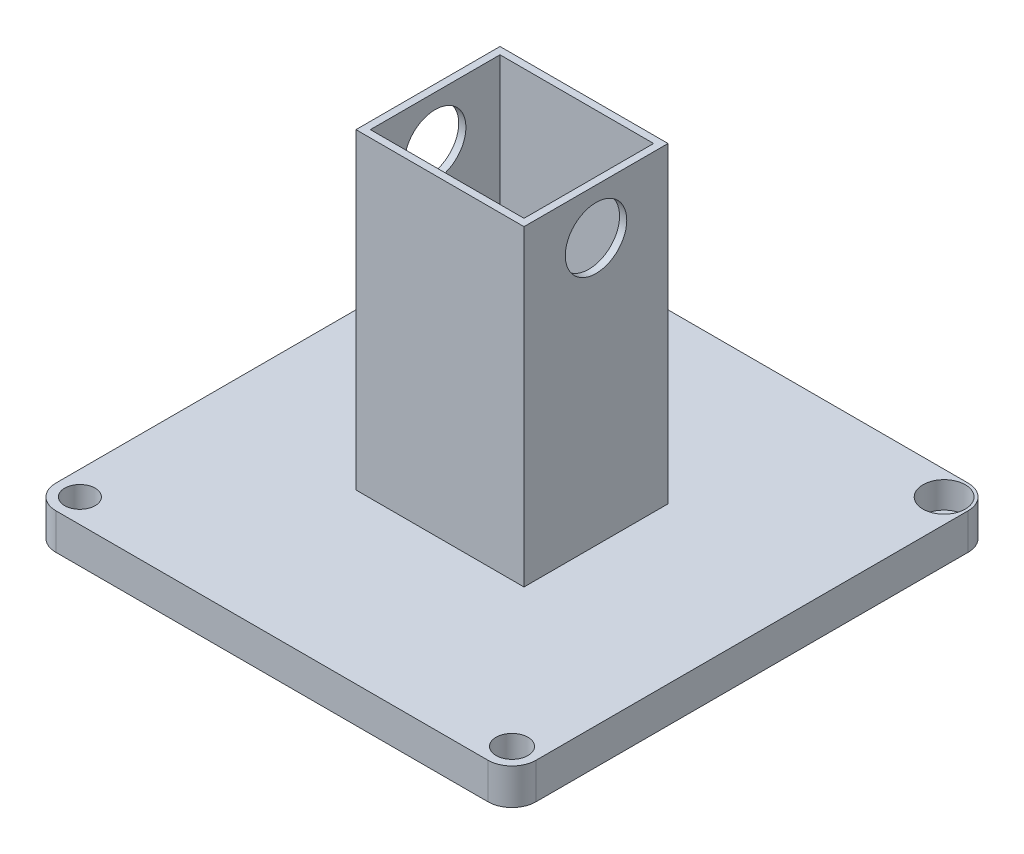
ISO-10303-21;
HEADER;
FILE_DESCRIPTION(('STEP AP214'),'2;1');
FILE_NAME('part.step','',(''),(''),'','','');
FILE_SCHEMA(('AUTOMOTIVE_DESIGN { 1 0 10303 214 1 1 1 1 }'));
ENDSEC;
DATA;
#1=APPLICATION_CONTEXT('core data for automotive mechanical design processes');
#2=APPLICATION_PROTOCOL_DEFINITION('international standard','automotive_design',2000,#1);
#3=PRODUCT_CONTEXT('',#1,'mechanical');
#4=PRODUCT('Part','Part','',(#3));
#5=PRODUCT_RELATED_PRODUCT_CATEGORY('part','',(#4));
#6=PRODUCT_DEFINITION_FORMATION('','',#4);
#7=PRODUCT_DEFINITION_CONTEXT('part definition',#1,'design');
#8=PRODUCT_DEFINITION('design','',#6,#7);
#9=PRODUCT_DEFINITION_SHAPE('','',#8);
#10=(LENGTH_UNIT() NAMED_UNIT(*) SI_UNIT(.MILLI.,.METRE.));
#11=(NAMED_UNIT(*) PLANE_ANGLE_UNIT() SI_UNIT($,.RADIAN.));
#12=(NAMED_UNIT(*) SI_UNIT($,.STERADIAN.) SOLID_ANGLE_UNIT());
#13=UNCERTAINTY_MEASURE_WITH_UNIT(LENGTH_MEASURE(1.E-05),#10,'distance_accuracy_value','');
#14=(GEOMETRIC_REPRESENTATION_CONTEXT(3) GLOBAL_UNCERTAINTY_ASSIGNED_CONTEXT((#13)) GLOBAL_UNIT_ASSIGNED_CONTEXT((#10,
#11,#12)) REPRESENTATION_CONTEXT('',''));
#15=CARTESIAN_POINT('',(0.,0.,0.));
#16=DIRECTION('',(0.,0.,1.));
#17=DIRECTION('',(1.,0.,0.));
#18=AXIS2_PLACEMENT_3D('',#15,#16,#17);
#19=CARTESIAN_POINT('',(90.,15.,-90.));
#20=DIRECTION('',(0.,-1.,0.));
#21=DIRECTION('',(0.,0.,-1.));
#22=AXIS2_PLACEMENT_3D('',#19,#20,#21);
#23=PLANE('',#22);
#24=CARTESIAN_POINT('',(90.,15.,-90.));
#25=DIRECTION('',(0.,1.,0.));
#26=DIRECTION('',(0.,0.,1.));
#27=AXIS2_PLACEMENT_3D('',#24,#25,#26);
#28=CIRCLE('',#27,8.81355523044858);
#29=CARTESIAN_POINT('',(90.,15.,-81.1864447695514));
#30=VERTEX_POINT('',#29);
#31=EDGE_CURVE('E442',#30,#30,#28,.T.);
#32=ORIENTED_EDGE('',*,*,#31,.F.);
#33=EDGE_LOOP('',(#32));
#34=FACE_BOUND('',#33,.T.);
#35=CARTESIAN_POINT('',(-90.,15.,90.));
#36=DIRECTION('',(0.,1.,0.));
#37=DIRECTION('',(0.,0.,1.));
#38=AXIS2_PLACEMENT_3D('',#35,#36,#37);
#39=CIRCLE('',#38,6.34028502442112);
#40=CARTESIAN_POINT('',(-90.,15.,96.3402850244211));
#41=VERTEX_POINT('',#40);
#42=EDGE_CURVE('E451',#41,#41,#39,.T.);
#43=ORIENTED_EDGE('',*,*,#42,.F.);
#44=EDGE_LOOP('',(#43));
#45=FACE_BOUND('',#44,.T.);
#46=CARTESIAN_POINT('',(90.,15.,90.));
#47=DIRECTION('',(0.,1.,0.));
#48=DIRECTION('',(0.,0.,1.));
#49=AXIS2_PLACEMENT_3D('',#46,#47,#48);
#50=CIRCLE('',#49,6.6333628858936);
#51=CARTESIAN_POINT('',(90.,15.,96.6333628858936));
#52=VERTEX_POINT('',#51);
#53=EDGE_CURVE('E457',#52,#52,#50,.T.);
#54=ORIENTED_EDGE('',*,*,#53,.F.);
#55=EDGE_LOOP('',(#54));
#56=FACE_BOUND('',#55,.T.);
#57=CARTESIAN_POINT('',(-90.,15.,-90.));
#58=DIRECTION('',(0.,1.,0.));
#59=DIRECTION('',(0.,0.,1.));
#60=AXIS2_PLACEMENT_3D('',#57,#58,#59);
#61=CIRCLE('',#60,8.19003124874953);
#62=CARTESIAN_POINT('',(-90.,15.,-81.8099687512505));
#63=VERTEX_POINT('',#62);
#64=EDGE_CURVE('E393',#63,#63,#61,.T.);
#65=ORIENTED_EDGE('',*,*,#64,.F.);
#66=EDGE_LOOP('',(#65));
#67=FACE_BOUND('',#66,.T.);
#68=CARTESIAN_POINT('',(90.,15.,-90.));
#69=DIRECTION('',(0.,1.,0.));
#70=DIRECTION('',(0.,0.,-1.));
#71=AXIS2_PLACEMENT_3D('',#68,#69,#70);
#72=CIRCLE('',#71,9.99999999999999);
#73=CARTESIAN_POINT('',(100.,15.,-90.));
#74=VERTEX_POINT('',#73);
#75=CARTESIAN_POINT('',(90.,15.,-100.));
#76=VERTEX_POINT('',#75);
#77=EDGE_CURVE('E217',#74,#76,#72,.T.);
#78=ORIENTED_EDGE('',*,*,#77,.T.);
#79=DIRECTION('',(-1.,0.,0.));
#80=VECTOR('',#79,1.);
#81=CARTESIAN_POINT('',(-90.,15.,-100.));
#82=LINE('',#81,#80);
#83=CARTESIAN_POINT('',(-90.,15.,-100.));
#84=VERTEX_POINT('',#83);
#85=EDGE_CURVE('E220',#76,#84,#82,.T.);
#86=ORIENTED_EDGE('',*,*,#85,.T.);
#87=CARTESIAN_POINT('',(-90.,15.,-90.));
#88=DIRECTION('',(0.,1.,0.));
#89=DIRECTION('',(0.,0.,1.));
#90=AXIS2_PLACEMENT_3D('',#87,#88,#89);
#91=CIRCLE('',#90,10.);
#92=CARTESIAN_POINT('',(-100.,15.,-90.));
#93=VERTEX_POINT('',#92);
#94=EDGE_CURVE('E223',#84,#93,#91,.T.);
#95=ORIENTED_EDGE('',*,*,#94,.T.);
#96=DIRECTION('',(0.,0.,1.));
#97=VECTOR('',#96,1.);
#98=CARTESIAN_POINT('',(-100.,15.,-90.));
#99=LINE('',#98,#97);
#100=CARTESIAN_POINT('',(-100.,15.,90.));
#101=VERTEX_POINT('',#100);
#102=EDGE_CURVE('E225',#93,#101,#99,.T.);
#103=ORIENTED_EDGE('',*,*,#102,.T.);
#104=CARTESIAN_POINT('',(-90.,15.,90.));
#105=DIRECTION('',(0.,1.,0.));
#106=DIRECTION('',(0.,0.,1.));
#107=AXIS2_PLACEMENT_3D('',#104,#105,#106);
#108=CIRCLE('',#107,9.99999999999999);
#109=CARTESIAN_POINT('',(-90.,15.,100.));
#110=VERTEX_POINT('',#109);
#111=EDGE_CURVE('E227',#101,#110,#108,.T.);
#112=ORIENTED_EDGE('',*,*,#111,.T.);
#113=DIRECTION('',(1.,0.,0.));
#114=VECTOR('',#113,1.);
#115=CARTESIAN_POINT('',(-90.,15.,100.));
#116=LINE('',#115,#114);
#117=CARTESIAN_POINT('',(90.,15.,100.));
#118=VERTEX_POINT('',#117);
#119=EDGE_CURVE('E229',#110,#118,#116,.T.);
#120=ORIENTED_EDGE('',*,*,#119,.T.);
#121=CARTESIAN_POINT('',(90.,15.,90.));
#122=DIRECTION('',(0.,1.,0.));
#123=DIRECTION('',(0.,0.,1.));
#124=AXIS2_PLACEMENT_3D('',#121,#122,#123);
#125=CIRCLE('',#124,9.99999999999998);
#126=CARTESIAN_POINT('',(100.,15.,90.));
#127=VERTEX_POINT('',#126);
#128=EDGE_CURVE('E231',#118,#127,#125,.T.);
#129=ORIENTED_EDGE('',*,*,#128,.T.);
#130=DIRECTION('',(0.,0.,-1.));
#131=VECTOR('',#130,1.);
#132=CARTESIAN_POINT('',(100.,15.,-90.));
#133=LINE('',#132,#131);
#134=EDGE_CURVE('E233',#127,#74,#133,.T.);
#135=ORIENTED_EDGE('',*,*,#134,.T.);
#136=EDGE_LOOP('',(#78,#86,#95,#103,#112,#120,#129,#135));
#137=FACE_BOUND('',#136,.T.);
#138=DIRECTION('',(0.,0.,-1.));
#139=VECTOR('',#138,1.);
#140=CARTESIAN_POINT('',(35.,15.,-30.));
#141=LINE('',#140,#139);
#142=CARTESIAN_POINT('',(35.,15.,30.));
#143=VERTEX_POINT('',#142);
#144=CARTESIAN_POINT('',(35.,15.,-30.));
#145=VERTEX_POINT('',#144);
#146=EDGE_CURVE('E163',#143,#145,#141,.T.);
#147=ORIENTED_EDGE('',*,*,#146,.F.);
#148=DIRECTION('',(1.,0.,0.));
#149=VECTOR('',#148,1.);
#150=CARTESIAN_POINT('',(-35.,15.,30.));
#151=LINE('',#150,#149);
#152=CARTESIAN_POINT('',(-35.,15.,30.));
#153=VERTEX_POINT('',#152);
#154=EDGE_CURVE('E193',#153,#143,#151,.T.);
#155=ORIENTED_EDGE('',*,*,#154,.F.);
#156=DIRECTION('',(0.,0.,1.));
#157=VECTOR('',#156,1.);
#158=CARTESIAN_POINT('',(-35.,15.,-30.));
#159=LINE('',#158,#157);
#160=CARTESIAN_POINT('',(-35.,15.,-30.));
#161=VERTEX_POINT('',#160);
#162=EDGE_CURVE('E53',#161,#153,#159,.T.);
#163=ORIENTED_EDGE('',*,*,#162,.F.);
#164=DIRECTION('',(-1.,0.,0.));
#165=VECTOR('',#164,1.);
#166=CARTESIAN_POINT('',(-35.,15.,-30.));
#167=LINE('',#166,#165);
#168=EDGE_CURVE('E48',#145,#161,#167,.T.);
#169=ORIENTED_EDGE('',*,*,#168,.F.);
#170=EDGE_LOOP('',(#147,#155,#163,#169));
#171=FACE_BOUND('',#170,.T.);
#172=ADVANCED_FACE('F32',(#34,#45,#56,#67,#137,#171),#23,.F.);
#173=CARTESIAN_POINT('',(90.,15.,-90.));
#174=DIRECTION('',(0.,-1.,0.));
#175=DIRECTION('',(0.,0.,-1.));
#176=AXIS2_PLACEMENT_3D('',#173,#174,#175);
#177=CYLINDRICAL_SURFACE('',#176,9.99999999999999);
#178=CARTESIAN_POINT('',(90.,0.,-90.));
#179=DIRECTION('',(0.,1.,0.));
#180=DIRECTION('',(0.,0.,-1.));
#181=AXIS2_PLACEMENT_3D('',#178,#179,#180);
#182=CIRCLE('',#181,9.99999999999999);
#183=CARTESIAN_POINT('',(100.,0.,-90.));
#184=VERTEX_POINT('',#183);
#185=CARTESIAN_POINT('',(90.,0.,-100.));
#186=VERTEX_POINT('',#185);
#187=EDGE_CURVE('E216',#184,#186,#182,.T.);
#188=ORIENTED_EDGE('',*,*,#187,.T.);
#189=DIRECTION('',(0.,-1.,0.));
#190=VECTOR('',#189,1.);
#191=CARTESIAN_POINT('',(90.,15.,-100.));
#192=LINE('',#191,#190);
#193=EDGE_CURVE('E11',#76,#186,#192,.T.);
#194=ORIENTED_EDGE('',*,*,#193,.F.);
#195=ORIENTED_EDGE('',*,*,#77,.F.);
#196=DIRECTION('',(0.,-1.,0.));
#197=VECTOR('',#196,1.);
#198=CARTESIAN_POINT('',(100.,15.,-90.));
#199=LINE('',#198,#197);
#200=EDGE_CURVE('E235',#74,#184,#199,.T.);
#201=ORIENTED_EDGE('',*,*,#200,.T.);
#202=EDGE_LOOP('',(#188,#194,#195,#201));
#203=FACE_BOUND('',#202,.T.);
#204=ADVANCED_FACE('F34',(#203),#177,.T.);
#205=CARTESIAN_POINT('',(-90.,15.,-100.));
#206=DIRECTION('',(0.,0.,1.));
#207=DIRECTION('',(1.,0.,0.));
#208=AXIS2_PLACEMENT_3D('',#205,#206,#207);
#209=PLANE('',#208);
#210=DIRECTION('',(-1.,0.,0.));
#211=VECTOR('',#210,1.);
#212=CARTESIAN_POINT('',(-90.,0.,-100.));
#213=LINE('',#212,#211);
#214=CARTESIAN_POINT('',(-90.,0.,-100.));
#215=VERTEX_POINT('',#214);
#216=EDGE_CURVE('E238',#186,#215,#213,.T.);
#217=ORIENTED_EDGE('',*,*,#216,.T.);
#218=DIRECTION('',(0.,-1.,0.));
#219=VECTOR('',#218,1.);
#220=CARTESIAN_POINT('',(-90.,15.,-100.));
#221=LINE('',#220,#219);
#222=EDGE_CURVE('E41',#84,#215,#221,.T.);
#223=ORIENTED_EDGE('',*,*,#222,.F.);
#224=ORIENTED_EDGE('',*,*,#85,.F.);
#225=ORIENTED_EDGE('',*,*,#193,.T.);
#226=EDGE_LOOP('',(#217,#223,#224,#225));
#227=FACE_BOUND('',#226,.T.);
#228=ADVANCED_FACE('F295',(#227),#209,.F.);
#229=CARTESIAN_POINT('',(-90.,15.,-90.));
#230=DIRECTION('',(0.,-1.,0.));
#231=DIRECTION('',(0.,0.,-1.));
#232=AXIS2_PLACEMENT_3D('',#229,#230,#231);
#233=CYLINDRICAL_SURFACE('',#232,10.);
#234=CARTESIAN_POINT('',(-90.,0.,-90.));
#235=DIRECTION('',(0.,1.,0.));
#236=DIRECTION('',(0.,0.,1.));
#237=AXIS2_PLACEMENT_3D('',#234,#235,#236);
#238=CIRCLE('',#237,10.);
#239=CARTESIAN_POINT('',(-100.,0.,-90.));
#240=VERTEX_POINT('',#239);
#241=EDGE_CURVE('E240',#215,#240,#238,.T.);
#242=ORIENTED_EDGE('',*,*,#241,.T.);
#243=DIRECTION('',(0.,-1.,0.));
#244=VECTOR('',#243,1.);
#245=CARTESIAN_POINT('',(-100.,15.,-90.));
#246=LINE('',#245,#244);
#247=EDGE_CURVE('E265',#93,#240,#246,.T.);
#248=ORIENTED_EDGE('',*,*,#247,.F.);
#249=ORIENTED_EDGE('',*,*,#94,.F.);
#250=ORIENTED_EDGE('',*,*,#222,.T.);
#251=EDGE_LOOP('',(#242,#248,#249,#250));
#252=FACE_BOUND('',#251,.T.);
#253=ADVANCED_FACE('F273',(#252),#233,.T.);
#254=CARTESIAN_POINT('',(-100.,15.,-90.));
#255=DIRECTION('',(1.,0.,0.));
#256=DIRECTION('',(0.,0.,-1.));
#257=AXIS2_PLACEMENT_3D('',#254,#255,#256);
#258=PLANE('',#257);
#259=DIRECTION('',(0.,0.,1.));
#260=VECTOR('',#259,1.);
#261=CARTESIAN_POINT('',(-100.,0.,-90.));
#262=LINE('',#261,#260);
#263=CARTESIAN_POINT('',(-100.,0.,90.));
#264=VERTEX_POINT('',#263);
#265=EDGE_CURVE('E242',#240,#264,#262,.T.);
#266=ORIENTED_EDGE('',*,*,#265,.T.);
#267=DIRECTION('',(0.,-1.,0.));
#268=VECTOR('',#267,1.);
#269=CARTESIAN_POINT('',(-100.,15.,90.));
#270=LINE('',#269,#268);
#271=EDGE_CURVE('E262',#101,#264,#270,.T.);
#272=ORIENTED_EDGE('',*,*,#271,.F.);
#273=ORIENTED_EDGE('',*,*,#102,.F.);
#274=ORIENTED_EDGE('',*,*,#247,.T.);
#275=EDGE_LOOP('',(#266,#272,#273,#274));
#276=FACE_BOUND('',#275,.T.);
#277=ADVANCED_FACE('F284',(#276),#258,.F.);
#278=CARTESIAN_POINT('',(-90.,15.,90.));
#279=DIRECTION('',(0.,-1.,0.));
#280=DIRECTION('',(0.,0.,-1.));
#281=AXIS2_PLACEMENT_3D('',#278,#279,#280);
#282=CYLINDRICAL_SURFACE('',#281,9.99999999999999);
#283=CARTESIAN_POINT('',(-90.,0.,90.));
#284=DIRECTION('',(0.,1.,0.));
#285=DIRECTION('',(0.,0.,1.));
#286=AXIS2_PLACEMENT_3D('',#283,#284,#285);
#287=CIRCLE('',#286,9.99999999999999);
#288=CARTESIAN_POINT('',(-90.,0.,100.));
#289=VERTEX_POINT('',#288);
#290=EDGE_CURVE('E244',#264,#289,#287,.T.);
#291=ORIENTED_EDGE('',*,*,#290,.T.);
#292=DIRECTION('',(0.,-1.,0.));
#293=VECTOR('',#292,1.);
#294=CARTESIAN_POINT('',(-90.,15.,100.));
#295=LINE('',#294,#293);
#296=EDGE_CURVE('E259',#110,#289,#295,.T.);
#297=ORIENTED_EDGE('',*,*,#296,.F.);
#298=ORIENTED_EDGE('',*,*,#111,.F.);
#299=ORIENTED_EDGE('',*,*,#271,.T.);
#300=EDGE_LOOP('',(#291,#297,#298,#299));
#301=FACE_BOUND('',#300,.T.);
#302=ADVANCED_FACE('F288',(#301),#282,.T.);
#303=CARTESIAN_POINT('',(-90.,15.,100.));
#304=DIRECTION('',(0.,0.,-1.));
#305=DIRECTION('',(-1.,0.,0.));
#306=AXIS2_PLACEMENT_3D('',#303,#304,#305);
#307=PLANE('',#306);
#308=DIRECTION('',(1.,0.,0.));
#309=VECTOR('',#308,1.);
#310=CARTESIAN_POINT('',(-90.,0.,100.));
#311=LINE('',#310,#309);
#312=CARTESIAN_POINT('',(90.,0.,100.));
#313=VERTEX_POINT('',#312);
#314=EDGE_CURVE('E246',#289,#313,#311,.T.);
#315=ORIENTED_EDGE('',*,*,#314,.T.);
#316=DIRECTION('',(0.,-1.,0.));
#317=VECTOR('',#316,1.);
#318=CARTESIAN_POINT('',(90.,15.,100.));
#319=LINE('',#318,#317);
#320=EDGE_CURVE('E256',#118,#313,#319,.T.);
#321=ORIENTED_EDGE('',*,*,#320,.F.);
#322=ORIENTED_EDGE('',*,*,#119,.F.);
#323=ORIENTED_EDGE('',*,*,#296,.T.);
#324=EDGE_LOOP('',(#315,#321,#322,#323));
#325=FACE_BOUND('',#324,.T.);
#326=ADVANCED_FACE('F308',(#325),#307,.F.);
#327=CARTESIAN_POINT('',(90.,15.,90.));
#328=DIRECTION('',(0.,-1.,0.));
#329=DIRECTION('',(0.,0.,-1.));
#330=AXIS2_PLACEMENT_3D('',#327,#328,#329);
#331=CYLINDRICAL_SURFACE('',#330,9.99999999999998);
#332=CARTESIAN_POINT('',(90.,0.,90.));
#333=DIRECTION('',(0.,1.,0.));
#334=DIRECTION('',(0.,0.,1.));
#335=AXIS2_PLACEMENT_3D('',#332,#333,#334);
#336=CIRCLE('',#335,9.99999999999998);
#337=CARTESIAN_POINT('',(100.,0.,90.));
#338=VERTEX_POINT('',#337);
#339=EDGE_CURVE('E248',#313,#338,#336,.T.);
#340=ORIENTED_EDGE('',*,*,#339,.T.);
#341=DIRECTION('',(0.,-1.,0.));
#342=VECTOR('',#341,1.);
#343=CARTESIAN_POINT('',(100.,15.,90.));
#344=LINE('',#343,#342);
#345=EDGE_CURVE('E253',#127,#338,#344,.T.);
#346=ORIENTED_EDGE('',*,*,#345,.F.);
#347=ORIENTED_EDGE('',*,*,#128,.F.);
#348=ORIENTED_EDGE('',*,*,#320,.T.);
#349=EDGE_LOOP('',(#340,#346,#347,#348));
#350=FACE_BOUND('',#349,.T.);
#351=ADVANCED_FACE('F306',(#350),#331,.T.);
#352=CARTESIAN_POINT('',(100.,15.,-90.));
#353=DIRECTION('',(-1.,0.,0.));
#354=DIRECTION('',(0.,0.,1.));
#355=AXIS2_PLACEMENT_3D('',#352,#353,#354);
#356=PLANE('',#355);
#357=DIRECTION('',(0.,0.,-1.));
#358=VECTOR('',#357,1.);
#359=CARTESIAN_POINT('',(100.,0.,-90.));
#360=LINE('',#359,#358);
#361=EDGE_CURVE('E221',#338,#184,#360,.T.);
#362=ORIENTED_EDGE('',*,*,#361,.T.);
#363=ORIENTED_EDGE('',*,*,#200,.F.);
#364=ORIENTED_EDGE('',*,*,#134,.F.);
#365=ORIENTED_EDGE('',*,*,#345,.T.);
#366=EDGE_LOOP('',(#362,#363,#364,#365));
#367=FACE_BOUND('',#366,.T.);
#368=ADVANCED_FACE('F301',(#367),#356,.F.);
#369=CARTESIAN_POINT('',(90.,0.,-90.));
#370=DIRECTION('',(0.,-1.,0.));
#371=DIRECTION('',(0.,0.,-1.));
#372=AXIS2_PLACEMENT_3D('',#369,#370,#371);
#373=PLANE('',#372);
#374=ORIENTED_EDGE('',*,*,#187,.F.);
#375=ORIENTED_EDGE('',*,*,#361,.F.);
#376=ORIENTED_EDGE('',*,*,#339,.F.);
#377=ORIENTED_EDGE('',*,*,#314,.F.);
#378=ORIENTED_EDGE('',*,*,#290,.F.);
#379=ORIENTED_EDGE('',*,*,#265,.F.);
#380=ORIENTED_EDGE('',*,*,#241,.F.);
#381=ORIENTED_EDGE('',*,*,#216,.F.);
#382=EDGE_LOOP('',(#374,#375,#376,#377,#378,#379,#380,#381));
#383=FACE_BOUND('',#382,.T.);
#384=ADVANCED_FACE('F279',(#383),#373,.T.);
#385=CARTESIAN_POINT('',(0.,145.,0.));
#386=DIRECTION('',(0.,1.,0.));
#387=DIRECTION('',(0.,0.,1.));
#388=AXIS2_PLACEMENT_3D('',#385,#386,#387);
#389=PLANE('',#388);
#390=DIRECTION('',(0.,0.,-1.));
#391=VECTOR('',#390,1.);
#392=CARTESIAN_POINT('',(35.,145.,-30.));
#393=LINE('',#392,#391);
#394=CARTESIAN_POINT('',(35.,145.,30.));
#395=VERTEX_POINT('',#394);
#396=CARTESIAN_POINT('',(35.,145.,-30.));
#397=VERTEX_POINT('',#396);
#398=EDGE_CURVE('E189',#395,#397,#393,.T.);
#399=ORIENTED_EDGE('',*,*,#398,.T.);
#400=DIRECTION('',(-1.,0.,0.));
#401=VECTOR('',#400,1.);
#402=CARTESIAN_POINT('',(-35.,145.,-30.));
#403=LINE('',#402,#401);
#404=CARTESIAN_POINT('',(-35.,145.,-30.));
#405=VERTEX_POINT('',#404);
#406=EDGE_CURVE('E192',#397,#405,#403,.T.);
#407=ORIENTED_EDGE('',*,*,#406,.T.);
#408=DIRECTION('',(0.,0.,1.));
#409=VECTOR('',#408,1.);
#410=CARTESIAN_POINT('',(-35.,145.,-30.));
#411=LINE('',#410,#409);
#412=CARTESIAN_POINT('',(-35.,145.,30.));
#413=VERTEX_POINT('',#412);
#414=EDGE_CURVE('E195',#405,#413,#411,.T.);
#415=ORIENTED_EDGE('',*,*,#414,.T.);
#416=DIRECTION('',(1.,0.,0.));
#417=VECTOR('',#416,1.);
#418=CARTESIAN_POINT('',(-35.,145.,30.));
#419=LINE('',#418,#417);
#420=EDGE_CURVE('E197',#413,#395,#419,.T.);
#421=ORIENTED_EDGE('',*,*,#420,.T.);
#422=EDGE_LOOP('',(#399,#407,#415,#421));
#423=FACE_BOUND('',#422,.T.);
#424=DIRECTION('',(0.,0.,1.));
#425=VECTOR('',#424,1.);
#426=CARTESIAN_POINT('',(-32.,145.,-27.));
#427=LINE('',#426,#425);
#428=CARTESIAN_POINT('',(-32.,145.,-27.));
#429=VERTEX_POINT('',#428);
#430=CARTESIAN_POINT('',(-32.,145.,27.));
#431=VERTEX_POINT('',#430);
#432=EDGE_CURVE('E155',#429,#431,#427,.T.);
#433=ORIENTED_EDGE('',*,*,#432,.F.);
#434=DIRECTION('',(-1.,0.,0.));
#435=VECTOR('',#434,1.);
#436=CARTESIAN_POINT('',(-32.,145.,-27.));
#437=LINE('',#436,#435);
#438=CARTESIAN_POINT('',(32.,145.,-27.));
#439=VERTEX_POINT('',#438);
#440=EDGE_CURVE('E145',#439,#429,#437,.T.);
#441=ORIENTED_EDGE('',*,*,#440,.F.);
#442=DIRECTION('',(0.,0.,-1.));
#443=VECTOR('',#442,1.);
#444=CARTESIAN_POINT('',(32.,145.,-27.));
#445=LINE('',#444,#443);
#446=CARTESIAN_POINT('',(32.,145.,27.));
#447=VERTEX_POINT('',#446);
#448=EDGE_CURVE('E171',#447,#439,#445,.T.);
#449=ORIENTED_EDGE('',*,*,#448,.F.);
#450=DIRECTION('',(1.,0.,0.));
#451=VECTOR('',#450,1.);
#452=CARTESIAN_POINT('',(-32.,145.,27.));
#453=LINE('',#452,#451);
#454=EDGE_CURVE('E169',#431,#447,#453,.T.);
#455=ORIENTED_EDGE('',*,*,#454,.F.);
#456=EDGE_LOOP('',(#433,#441,#449,#455));
#457=FACE_BOUND('',#456,.T.);
#458=ADVANCED_FACE('F167',(#423,#457),#389,.T.);
#459=CARTESIAN_POINT('',(35.,145.,-30.));
#460=DIRECTION('',(-1.,0.,0.));
#461=DIRECTION('',(0.,0.,1.));
#462=AXIS2_PLACEMENT_3D('',#459,#460,#461);
#463=PLANE('',#462);
#464=CARTESIAN_POINT('',(35.,125.915041200934,0.));
#465=DIRECTION('',(1.,0.,0.));
#466=DIRECTION('',(0.,0.,-1.));
#467=AXIS2_PLACEMENT_3D('',#464,#465,#466);
#468=CIRCLE('',#467,12.8049075331907);
#469=CARTESIAN_POINT('',(35.,125.915041200934,-12.8049075331907));
#470=VERTEX_POINT('',#469);
#471=EDGE_CURVE('E378',#470,#470,#468,.T.);
#472=ORIENTED_EDGE('',*,*,#471,.F.);
#473=EDGE_LOOP('',(#472));
#474=FACE_BOUND('',#473,.T.);
#475=ORIENTED_EDGE('',*,*,#146,.T.);
#476=DIRECTION('',(0.,-1.,0.));
#477=VECTOR('',#476,1.);
#478=CARTESIAN_POINT('',(35.,145.,-30.));
#479=LINE('',#478,#477);
#480=EDGE_CURVE('E214',#397,#145,#479,.T.);
#481=ORIENTED_EDGE('',*,*,#480,.F.);
#482=ORIENTED_EDGE('',*,*,#398,.F.);
#483=DIRECTION('',(0.,-1.,0.));
#484=VECTOR('',#483,1.);
#485=CARTESIAN_POINT('',(35.,145.,30.));
#486=LINE('',#485,#484);
#487=EDGE_CURVE('E199',#395,#143,#486,.T.);
#488=ORIENTED_EDGE('',*,*,#487,.T.);
#489=EDGE_LOOP('',(#475,#481,#482,#488));
#490=FACE_BOUND('',#489,.T.);
#491=ADVANCED_FACE('F359',(#474,#490),#463,.F.);
#492=CARTESIAN_POINT('',(-35.,145.,-30.));
#493=DIRECTION('',(0.,0.,1.));
#494=DIRECTION('',(1.,0.,0.));
#495=AXIS2_PLACEMENT_3D('',#492,#493,#494);
#496=PLANE('',#495);
#497=ORIENTED_EDGE('',*,*,#168,.T.);
#498=DIRECTION('',(0.,-1.,0.));
#499=VECTOR('',#498,1.);
#500=CARTESIAN_POINT('',(-35.,145.,-30.));
#501=LINE('',#500,#499);
#502=EDGE_CURVE('E211',#405,#161,#501,.T.);
#503=ORIENTED_EDGE('',*,*,#502,.F.);
#504=ORIENTED_EDGE('',*,*,#406,.F.);
#505=ORIENTED_EDGE('',*,*,#480,.T.);
#506=EDGE_LOOP('',(#497,#503,#504,#505));
#507=FACE_BOUND('',#506,.T.);
#508=ADVANCED_FACE('F367',(#507),#496,.F.);
#509=CARTESIAN_POINT('',(-35.,145.,-30.));
#510=DIRECTION('',(1.,0.,0.));
#511=DIRECTION('',(0.,0.,-1.));
#512=AXIS2_PLACEMENT_3D('',#509,#510,#511);
#513=PLANE('',#512);
#514=CARTESIAN_POINT('',(-35.,125.915041200934,0.));
#515=DIRECTION('',(1.,0.,0.));
#516=DIRECTION('',(0.,0.,-1.));
#517=AXIS2_PLACEMENT_3D('',#514,#515,#516);
#518=CIRCLE('',#517,12.8049075331907);
#519=CARTESIAN_POINT('',(-35.,125.915041200934,-12.8049075331907));
#520=VERTEX_POINT('',#519);
#521=EDGE_CURVE('E178',#520,#520,#518,.T.);
#522=ORIENTED_EDGE('',*,*,#521,.T.);
#523=EDGE_LOOP('',(#522));
#524=FACE_BOUND('',#523,.T.);
#525=ORIENTED_EDGE('',*,*,#162,.T.);
#526=DIRECTION('',(0.,-1.,0.));
#527=VECTOR('',#526,1.);
#528=CARTESIAN_POINT('',(-35.,145.,30.));
#529=LINE('',#528,#527);
#530=EDGE_CURVE('E208',#413,#153,#529,.T.);
#531=ORIENTED_EDGE('',*,*,#530,.F.);
#532=ORIENTED_EDGE('',*,*,#414,.F.);
#533=ORIENTED_EDGE('',*,*,#502,.T.);
#534=EDGE_LOOP('',(#525,#531,#532,#533));
#535=FACE_BOUND('',#534,.T.);
#536=ADVANCED_FACE('F363',(#524,#535),#513,.F.);
#537=CARTESIAN_POINT('',(-35.,145.,30.));
#538=DIRECTION('',(0.,0.,-1.));
#539=DIRECTION('',(-1.,0.,0.));
#540=AXIS2_PLACEMENT_3D('',#537,#538,#539);
#541=PLANE('',#540);
#542=ORIENTED_EDGE('',*,*,#154,.T.);
#543=ORIENTED_EDGE('',*,*,#487,.F.);
#544=ORIENTED_EDGE('',*,*,#420,.F.);
#545=ORIENTED_EDGE('',*,*,#530,.T.);
#546=EDGE_LOOP('',(#542,#543,#544,#545));
#547=FACE_BOUND('',#546,.T.);
#548=ADVANCED_FACE('F356',(#547),#541,.F.);
#549=CARTESIAN_POINT('',(-32.,145.,-27.));
#550=DIRECTION('',(0.,0.,1.));
#551=DIRECTION('',(1.,0.,0.));
#552=AXIS2_PLACEMENT_3D('',#549,#550,#551);
#553=PLANE('',#552);
#554=DIRECTION('',(-1.,0.,0.));
#555=VECTOR('',#554,1.);
#556=CARTESIAN_POINT('',(-32.,15.,-27.));
#557=LINE('',#556,#555);
#558=CARTESIAN_POINT('',(32.,15.,-27.));
#559=VERTEX_POINT('',#558);
#560=CARTESIAN_POINT('',(-32.,15.,-27.));
#561=VERTEX_POINT('',#560);
#562=EDGE_CURVE('E176',#559,#561,#557,.T.);
#563=ORIENTED_EDGE('',*,*,#562,.F.);
#564=DIRECTION('',(0.,-1.,0.));
#565=VECTOR('',#564,1.);
#566=CARTESIAN_POINT('',(32.,145.,-27.));
#567=LINE('',#566,#565);
#568=EDGE_CURVE('E151',#439,#559,#567,.T.);
#569=ORIENTED_EDGE('',*,*,#568,.F.);
#570=ORIENTED_EDGE('',*,*,#440,.T.);
#571=DIRECTION('',(0.,-1.,0.));
#572=VECTOR('',#571,1.);
#573=CARTESIAN_POINT('',(-32.,145.,-27.));
#574=LINE('',#573,#572);
#575=EDGE_CURVE('E149',#429,#561,#574,.T.);
#576=ORIENTED_EDGE('',*,*,#575,.T.);
#577=EDGE_LOOP('',(#563,#569,#570,#576));
#578=FACE_BOUND('',#577,.T.);
#579=ADVANCED_FACE('F148',(#578),#553,.T.);
#580=CARTESIAN_POINT('',(-32.,145.,-27.));
#581=DIRECTION('',(1.,0.,0.));
#582=DIRECTION('',(0.,0.,-1.));
#583=AXIS2_PLACEMENT_3D('',#580,#581,#582);
#584=PLANE('',#583);
#585=CARTESIAN_POINT('',(-32.,125.915041200934,0.));
#586=DIRECTION('',(1.,0.,0.));
#587=DIRECTION('',(0.,0.,-1.));
#588=AXIS2_PLACEMENT_3D('',#585,#586,#587);
#589=CIRCLE('',#588,12.8049075331907);
#590=CARTESIAN_POINT('',(-32.,125.915041200934,-12.8049075331907));
#591=VERTEX_POINT('',#590);
#592=EDGE_CURVE('E391',#591,#591,#589,.T.);
#593=ORIENTED_EDGE('',*,*,#592,.F.);
#594=EDGE_LOOP('',(#593));
#595=FACE_BOUND('',#594,.T.);
#596=DIRECTION('',(0.,0.,1.));
#597=VECTOR('',#596,1.);
#598=CARTESIAN_POINT('',(-32.,15.,-27.));
#599=LINE('',#598,#597);
#600=CARTESIAN_POINT('',(-32.,15.,27.));
#601=VERTEX_POINT('',#600);
#602=EDGE_CURVE('E162',#561,#601,#599,.T.);
#603=ORIENTED_EDGE('',*,*,#602,.F.);
#604=ORIENTED_EDGE('',*,*,#575,.F.);
#605=ORIENTED_EDGE('',*,*,#432,.T.);
#606=DIRECTION('',(0.,-1.,0.));
#607=VECTOR('',#606,1.);
#608=CARTESIAN_POINT('',(-32.,145.,27.));
#609=LINE('',#608,#607);
#610=EDGE_CURVE('E164',#431,#601,#609,.T.);
#611=ORIENTED_EDGE('',*,*,#610,.T.);
#612=EDGE_LOOP('',(#603,#604,#605,#611));
#613=FACE_BOUND('',#612,.T.);
#614=ADVANCED_FACE('F159',(#595,#613),#584,.T.);
#615=CARTESIAN_POINT('',(-32.,145.,27.));
#616=DIRECTION('',(0.,0.,-1.));
#617=DIRECTION('',(-1.,0.,0.));
#618=AXIS2_PLACEMENT_3D('',#615,#616,#617);
#619=PLANE('',#618);
#620=DIRECTION('',(1.,0.,0.));
#621=VECTOR('',#620,1.);
#622=CARTESIAN_POINT('',(-32.,15.,27.));
#623=LINE('',#622,#621);
#624=CARTESIAN_POINT('',(32.,15.,27.));
#625=VERTEX_POINT('',#624);
#626=EDGE_CURVE('E180',#601,#625,#623,.T.);
#627=ORIENTED_EDGE('',*,*,#626,.F.);
#628=ORIENTED_EDGE('',*,*,#610,.F.);
#629=ORIENTED_EDGE('',*,*,#454,.T.);
#630=DIRECTION('',(0.,-1.,0.));
#631=VECTOR('',#630,1.);
#632=CARTESIAN_POINT('',(32.,145.,27.));
#633=LINE('',#632,#631);
#634=EDGE_CURVE('E186',#447,#625,#633,.T.);
#635=ORIENTED_EDGE('',*,*,#634,.T.);
#636=EDGE_LOOP('',(#627,#628,#629,#635));
#637=FACE_BOUND('',#636,.T.);
#638=ADVANCED_FACE('F339',(#637),#619,.T.);
#639=CARTESIAN_POINT('',(32.,145.,-27.));
#640=DIRECTION('',(-1.,0.,0.));
#641=DIRECTION('',(0.,0.,1.));
#642=AXIS2_PLACEMENT_3D('',#639,#640,#641);
#643=PLANE('',#642);
#644=CARTESIAN_POINT('',(32.,125.915041200934,0.));
#645=DIRECTION('',(-1.,0.,0.));
#646=DIRECTION('',(0.,0.,1.));
#647=AXIS2_PLACEMENT_3D('',#644,#645,#646);
#648=CIRCLE('',#647,12.8049075331907);
#649=CARTESIAN_POINT('',(32.,125.915041200934,12.8049075331907));
#650=VERTEX_POINT('',#649);
#651=EDGE_CURVE('E36',#650,#650,#648,.T.);
#652=ORIENTED_EDGE('',*,*,#651,.F.);
#653=EDGE_LOOP('',(#652));
#654=FACE_BOUND('',#653,.T.);
#655=DIRECTION('',(0.,0.,-1.));
#656=VECTOR('',#655,1.);
#657=CARTESIAN_POINT('',(32.,15.,-27.));
#658=LINE('',#657,#656);
#659=EDGE_CURVE('E156',#625,#559,#658,.T.);
#660=ORIENTED_EDGE('',*,*,#659,.F.);
#661=ORIENTED_EDGE('',*,*,#634,.F.);
#662=ORIENTED_EDGE('',*,*,#448,.T.);
#663=ORIENTED_EDGE('',*,*,#568,.T.);
#664=EDGE_LOOP('',(#660,#661,#662,#663));
#665=FACE_BOUND('',#664,.T.);
#666=ADVANCED_FACE('F330',(#654,#665),#643,.T.);
#667=ORIENTED_EDGE('',*,*,#659,.T.);
#668=ORIENTED_EDGE('',*,*,#562,.T.);
#669=ORIENTED_EDGE('',*,*,#602,.T.);
#670=ORIENTED_EDGE('',*,*,#626,.T.);
#671=EDGE_LOOP('',(#667,#668,#669,#670));
#672=FACE_BOUND('',#671,.T.);
#673=ADVANCED_FACE('F320',(#672),#23,.F.);
#674=CARTESIAN_POINT('',(-53.,125.915041200934,0.));
#675=DIRECTION('',(1.,0.,0.));
#676=DIRECTION('',(0.,0.,-1.));
#677=AXIS2_PLACEMENT_3D('',#674,#675,#676);
#678=CYLINDRICAL_SURFACE('',#677,12.8049075331907);
#679=ORIENTED_EDGE('',*,*,#651,.T.);
#680=EDGE_LOOP('',(#679));
#681=FACE_BOUND('',#680,.T.);
#682=ORIENTED_EDGE('',*,*,#471,.T.);
#683=EDGE_LOOP('',(#682));
#684=FACE_BOUND('',#683,.T.);
#685=ADVANCED_FACE('F329',(#681,#684),#678,.F.);
#686=ORIENTED_EDGE('',*,*,#592,.T.);
#687=EDGE_LOOP('',(#686));
#688=FACE_BOUND('',#687,.T.);
#689=ORIENTED_EDGE('',*,*,#521,.F.);
#690=EDGE_LOOP('',(#689));
#691=FACE_BOUND('',#690,.T.);
#692=ADVANCED_FACE('F336',(#688,#691),#678,.F.);
#693=CARTESIAN_POINT('',(-90.,4.00000000000001,-90.));
#694=DIRECTION('',(0.,1.,0.));
#695=DIRECTION('',(0.,0.,1.));
#696=AXIS2_PLACEMENT_3D('',#693,#694,#695);
#697=CYLINDRICAL_SURFACE('',#696,8.19003124874953);
#698=CARTESIAN_POINT('',(-90.,4.00000000000001,-90.));
#699=DIRECTION('',(0.,1.,0.));
#700=DIRECTION('',(0.,0.,1.));
#701=AXIS2_PLACEMENT_3D('',#698,#699,#700);
#702=CIRCLE('',#701,8.19003124874953);
#703=CARTESIAN_POINT('',(-90.,4.00000000000001,-81.8099687512505));
#704=VERTEX_POINT('',#703);
#705=EDGE_CURVE('E388',#704,#704,#702,.T.);
#706=ORIENTED_EDGE('',*,*,#705,.F.);
#707=EDGE_LOOP('',(#706));
#708=FACE_BOUND('',#707,.T.);
#709=ORIENTED_EDGE('',*,*,#64,.T.);
#710=EDGE_LOOP('',(#709));
#711=FACE_BOUND('',#710,.T.);
#712=ADVANCED_FACE('F402',(#708,#711),#697,.F.);
#713=CARTESIAN_POINT('',(-90.,4.00000000000001,-90.));
#714=DIRECTION('',(0.,1.,0.));
#715=DIRECTION('',(0.,0.,1.));
#716=AXIS2_PLACEMENT_3D('',#713,#714,#715);
#717=PLANE('',#716);
#718=ORIENTED_EDGE('',*,*,#705,.T.);
#719=EDGE_LOOP('',(#718));
#720=FACE_BOUND('',#719,.T.);
#721=ADVANCED_FACE('F407',(#720),#717,.T.);
#722=CARTESIAN_POINT('',(90.,4.00000000000001,90.));
#723=DIRECTION('',(0.,1.,0.));
#724=DIRECTION('',(0.,0.,1.));
#725=AXIS2_PLACEMENT_3D('',#722,#723,#724);
#726=CYLINDRICAL_SURFACE('',#725,6.6333628858936);
#727=CARTESIAN_POINT('',(90.,4.00000000000001,90.));
#728=DIRECTION('',(0.,1.,0.));
#729=DIRECTION('',(0.,0.,1.));
#730=AXIS2_PLACEMENT_3D('',#727,#728,#729);
#731=CIRCLE('',#730,6.6333628858936);
#732=CARTESIAN_POINT('',(90.,4.00000000000001,96.6333628858936));
#733=VERTEX_POINT('',#732);
#734=EDGE_CURVE('E454',#733,#733,#731,.T.);
#735=ORIENTED_EDGE('',*,*,#734,.F.);
#736=EDGE_LOOP('',(#735));
#737=FACE_BOUND('',#736,.T.);
#738=ORIENTED_EDGE('',*,*,#53,.T.);
#739=EDGE_LOOP('',(#738));
#740=FACE_BOUND('',#739,.T.);
#741=ADVANCED_FACE('F413',(#737,#740),#726,.F.);
#742=CARTESIAN_POINT('',(90.,4.00000000000001,90.));
#743=DIRECTION('',(0.,1.,0.));
#744=DIRECTION('',(0.,0.,1.));
#745=AXIS2_PLACEMENT_3D('',#742,#743,#744);
#746=PLANE('',#745);
#747=ORIENTED_EDGE('',*,*,#734,.T.);
#748=EDGE_LOOP('',(#747));
#749=FACE_BOUND('',#748,.T.);
#750=ADVANCED_FACE('F417',(#749),#746,.T.);
#751=CARTESIAN_POINT('',(-90.,4.00000000000001,90.));
#752=DIRECTION('',(0.,1.,0.));
#753=DIRECTION('',(0.,0.,1.));
#754=AXIS2_PLACEMENT_3D('',#751,#752,#753);
#755=CYLINDRICAL_SURFACE('',#754,6.34028502442112);
#756=CARTESIAN_POINT('',(-90.,4.00000000000001,90.));
#757=DIRECTION('',(0.,1.,0.));
#758=DIRECTION('',(0.,0.,1.));
#759=AXIS2_PLACEMENT_3D('',#756,#757,#758);
#760=CIRCLE('',#759,6.34028502442112);
#761=CARTESIAN_POINT('',(-90.,4.00000000000001,96.3402850244211));
#762=VERTEX_POINT('',#761);
#763=EDGE_CURVE('E446',#762,#762,#760,.T.);
#764=ORIENTED_EDGE('',*,*,#763,.F.);
#765=EDGE_LOOP('',(#764));
#766=FACE_BOUND('',#765,.T.);
#767=ORIENTED_EDGE('',*,*,#42,.T.);
#768=EDGE_LOOP('',(#767));
#769=FACE_BOUND('',#768,.T.);
#770=ADVANCED_FACE('F421',(#766,#769),#755,.F.);
#771=CARTESIAN_POINT('',(-90.,4.00000000000001,90.));
#772=DIRECTION('',(0.,1.,0.));
#773=DIRECTION('',(0.,0.,1.));
#774=AXIS2_PLACEMENT_3D('',#771,#772,#773);
#775=PLANE('',#774);
#776=ORIENTED_EDGE('',*,*,#763,.T.);
#777=EDGE_LOOP('',(#776));
#778=FACE_BOUND('',#777,.T.);
#779=ADVANCED_FACE('F425',(#778),#775,.T.);
#780=CARTESIAN_POINT('',(90.,4.00000000000001,-90.));
#781=DIRECTION('',(0.,1.,0.));
#782=DIRECTION('',(0.,0.,1.));
#783=AXIS2_PLACEMENT_3D('',#780,#781,#782);
#784=CYLINDRICAL_SURFACE('',#783,8.81355523044858);
#785=CARTESIAN_POINT('',(90.,4.00000000000001,-90.));
#786=DIRECTION('',(0.,1.,0.));
#787=DIRECTION('',(0.,0.,1.));
#788=AXIS2_PLACEMENT_3D('',#785,#786,#787);
#789=CIRCLE('',#788,8.81355523044858);
#790=CARTESIAN_POINT('',(90.,4.00000000000001,-81.1864447695514));
#791=VERTEX_POINT('',#790);
#792=EDGE_CURVE('E441',#791,#791,#789,.T.);
#793=ORIENTED_EDGE('',*,*,#792,.F.);
#794=EDGE_LOOP('',(#793));
#795=FACE_BOUND('',#794,.T.);
#796=ORIENTED_EDGE('',*,*,#31,.T.);
#797=EDGE_LOOP('',(#796));
#798=FACE_BOUND('',#797,.T.);
#799=ADVANCED_FACE('F429',(#795,#798),#784,.F.);
#800=CARTESIAN_POINT('',(90.,4.00000000000001,-90.));
#801=DIRECTION('',(0.,1.,0.));
#802=DIRECTION('',(0.,0.,1.));
#803=AXIS2_PLACEMENT_3D('',#800,#801,#802);
#804=PLANE('',#803);
#805=ORIENTED_EDGE('',*,*,#792,.T.);
#806=EDGE_LOOP('',(#805));
#807=FACE_BOUND('',#806,.T.);
#808=ADVANCED_FACE('F433',(#807),#804,.T.);
#809=CLOSED_SHELL('',(#172,#204,#228,#253,#277,#302,#326,#351,#368,#384,#458,#491,#508,#536,
#548,#579,#614,#638,#666,#673,#685,#692,#712,#721,#741,#750,#770,#779,#799,#808));
#810=MANIFOLD_SOLID_BREP('B2',#809);
#811=ADVANCED_BREP_SHAPE_REPRESENTATION('',(#18,#810),#14);
#812=SHAPE_DEFINITION_REPRESENTATION(#9,#811);
ENDSEC;
END-ISO-10303-21;
